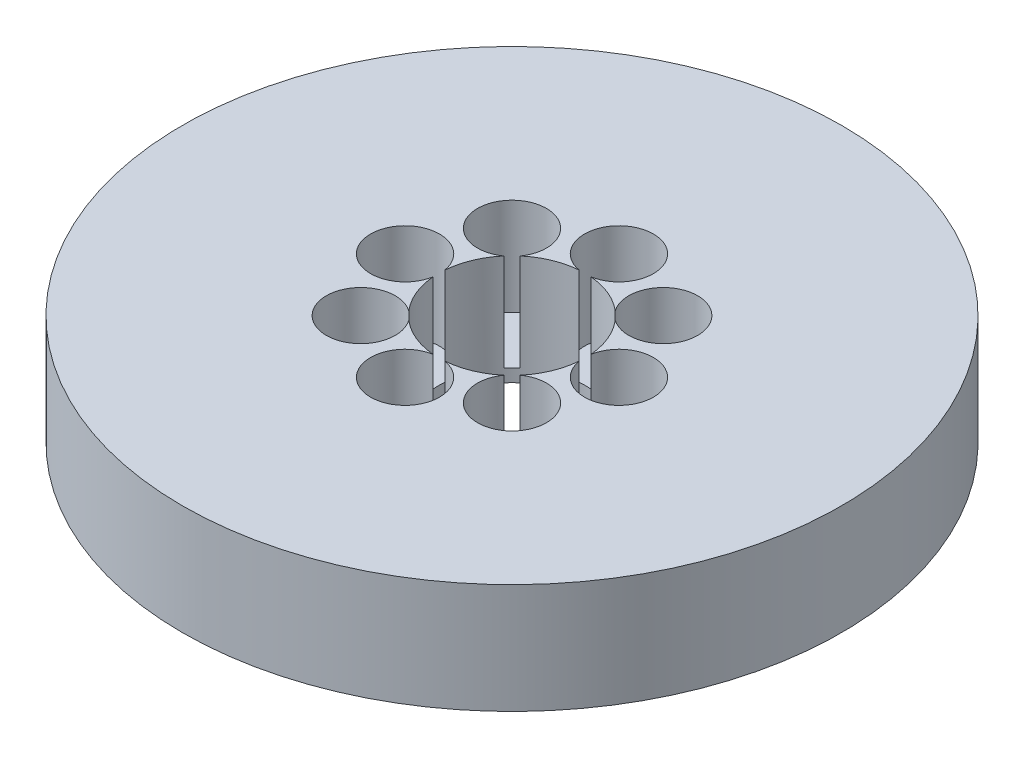
ISO-10303-21;
HEADER;
FILE_DESCRIPTION(('STEP AP214'),'2;1');
FILE_NAME('part.step','',(''),(''),'','','');
FILE_SCHEMA(('AUTOMOTIVE_DESIGN { 1 0 10303 214 1 1 1 1 }'));
ENDSEC;
DATA;
#1=APPLICATION_CONTEXT('core data for automotive mechanical design processes');
#2=APPLICATION_PROTOCOL_DEFINITION('international standard','automotive_design',2000,#1);
#3=PRODUCT_CONTEXT('',#1,'mechanical');
#4=PRODUCT('Part','Part','',(#3));
#5=PRODUCT_RELATED_PRODUCT_CATEGORY('part','',(#4));
#6=PRODUCT_DEFINITION_FORMATION('','',#4);
#7=PRODUCT_DEFINITION_CONTEXT('part definition',#1,'design');
#8=PRODUCT_DEFINITION('design','',#6,#7);
#9=PRODUCT_DEFINITION_SHAPE('','',#8);
#10=(LENGTH_UNIT() NAMED_UNIT(*) SI_UNIT(.MILLI.,.METRE.));
#11=(NAMED_UNIT(*) PLANE_ANGLE_UNIT() SI_UNIT($,.RADIAN.));
#12=(NAMED_UNIT(*) SI_UNIT($,.STERADIAN.) SOLID_ANGLE_UNIT());
#13=UNCERTAINTY_MEASURE_WITH_UNIT(LENGTH_MEASURE(1.E-05),#10,'distance_accuracy_value','');
#14=(GEOMETRIC_REPRESENTATION_CONTEXT(3) GLOBAL_UNCERTAINTY_ASSIGNED_CONTEXT((#13)) GLOBAL_UNIT_ASSIGNED_CONTEXT((#10,
#11,#12)) REPRESENTATION_CONTEXT('',''));
#15=CARTESIAN_POINT('',(0.,0.,0.));
#16=DIRECTION('',(0.,0.,1.));
#17=DIRECTION('',(1.,0.,0.));
#18=AXIS2_PLACEMENT_3D('',#15,#16,#17);
#19=CARTESIAN_POINT('',(0.,30.,0.));
#20=DIRECTION('',(0.,-1.,0.));
#21=DIRECTION('',(0.,0.,-1.));
#22=AXIS2_PLACEMENT_3D('',#19,#20,#21);
#23=CYLINDRICAL_SURFACE('',#22,90.);
#24=CARTESIAN_POINT('',(0.,30.,0.));
#25=DIRECTION('',(0.,1.,0.));
#26=DIRECTION('',(0.,0.,1.));
#27=AXIS2_PLACEMENT_3D('',#24,#25,#26);
#28=CIRCLE('',#27,90.);
#29=CARTESIAN_POINT('',(0.,30.,90.));
#30=VERTEX_POINT('',#29);
#31=EDGE_CURVE('E195',#30,#30,#28,.T.);
#32=ORIENTED_EDGE('',*,*,#31,.F.);
#33=EDGE_LOOP('',(#32));
#34=FACE_BOUND('',#33,.T.);
#35=CARTESIAN_POINT('',(0.,0.,0.));
#36=DIRECTION('',(0.,1.,0.));
#37=DIRECTION('',(0.,0.,1.));
#38=AXIS2_PLACEMENT_3D('',#35,#36,#37);
#39=CIRCLE('',#38,90.);
#40=CARTESIAN_POINT('',(0.,0.,90.));
#41=VERTEX_POINT('',#40);
#42=EDGE_CURVE('E179',#41,#41,#39,.T.);
#43=ORIENTED_EDGE('',*,*,#42,.T.);
#44=EDGE_LOOP('',(#43));
#45=FACE_BOUND('',#44,.T.);
#46=ADVANCED_FACE('F39',(#34,#45),#23,.T.);
#47=CARTESIAN_POINT('',(0.,30.,0.));
#48=DIRECTION('',(0.,1.,0.));
#49=DIRECTION('',(0.,0.,1.));
#50=AXIS2_PLACEMENT_3D('',#47,#48,#49);
#51=PLANE('',#50);
#52=CARTESIAN_POINT('',(1.01968902013866E-13,30.,29.2050542786669));
#53=DIRECTION('',(0.,1.,0.));
#54=DIRECTION('',(1.,0.,0.));
#55=AXIS2_PLACEMENT_3D('',#52,#53,#54);
#56=CIRCLE('',#55,9.40373495178159);
#57=CARTESIAN_POINT('',(-1.58993351933983,30.,19.9367026211478));
#58=VERTEX_POINT('',#57);
#59=CARTESIAN_POINT('',(1.58993351933997,30.,19.9367026211477));
#60=VERTEX_POINT('',#59);
#61=EDGE_CURVE('E176',#58,#60,#56,.T.);
#62=ORIENTED_EDGE('',*,*,#61,.F.);
#63=CARTESIAN_POINT('',(0.,30.,0.));
#64=DIRECTION('',(0.,1.,0.));
#65=DIRECTION('',(0.,0.,1.));
#66=AXIS2_PLACEMENT_3D('',#63,#64,#65);
#67=CIRCLE('',#66,20.);
#68=CARTESIAN_POINT('',(-12.9731248447521,30.,15.2216303910742));
#69=VERTEX_POINT('',#68);
#70=EDGE_CURVE('E166',#69,#58,#67,.T.);
#71=ORIENTED_EDGE('',*,*,#70,.F.);
#72=CARTESIAN_POINT('',(-20.6510919253665,30.,20.6510919253666));
#73=DIRECTION('',(0.,1.,0.));
#74=DIRECTION('',(0.707106781186549,0.,0.707106781186546));
#75=AXIS2_PLACEMENT_3D('',#72,#73,#74);
#76=CIRCLE('',#75,9.40373495178159);
#77=CARTESIAN_POINT('',(-15.2216303910742,30.,12.9731248447522));
#78=VERTEX_POINT('',#77);
#79=EDGE_CURVE('E147',#78,#69,#76,.T.);
#80=ORIENTED_EDGE('',*,*,#79,.F.);
#81=CARTESIAN_POINT('',(-19.9367026211477,30.,1.5899335193399));
#82=VERTEX_POINT('',#81);
#83=EDGE_CURVE('E180',#82,#78,#67,.T.);
#84=ORIENTED_EDGE('',*,*,#83,.F.);
#85=CARTESIAN_POINT('',(-29.2050542786669,30.,0.));
#86=DIRECTION('',(0.,1.,0.));
#87=DIRECTION('',(0.,0.,1.));
#88=AXIS2_PLACEMENT_3D('',#85,#86,#87);
#89=CIRCLE('',#88,9.40373495178159);
#90=CARTESIAN_POINT('',(-19.9367026211477,30.,-1.5899335193399));
#91=VERTEX_POINT('',#90);
#92=EDGE_CURVE('E186',#91,#82,#89,.T.);
#93=ORIENTED_EDGE('',*,*,#92,.F.);
#94=CARTESIAN_POINT('',(-15.2216303910744,30.,-12.973124844752));
#95=VERTEX_POINT('',#94);
#96=EDGE_CURVE('E182',#95,#91,#67,.T.);
#97=ORIENTED_EDGE('',*,*,#96,.F.);
#98=CARTESIAN_POINT('',(-20.6510919253668,30.,-20.6510919253663));
#99=DIRECTION('',(0.,1.,0.));
#100=DIRECTION('',(-0.707106781186539,0.,0.707106781186556));
#101=AXIS2_PLACEMENT_3D('',#98,#99,#100);
#102=CIRCLE('',#101,9.40373495178159);
#103=CARTESIAN_POINT('',(-12.9731248447523,30.,-15.2216303910741));
#104=VERTEX_POINT('',#103);
#105=EDGE_CURVE('E446',#104,#95,#102,.T.);
#106=ORIENTED_EDGE('',*,*,#105,.F.);
#107=CARTESIAN_POINT('',(-1.58993351934011,30.,-19.9367026211477));
#108=VERTEX_POINT('',#107);
#109=EDGE_CURVE('E452',#108,#104,#67,.T.);
#110=ORIENTED_EDGE('',*,*,#109,.F.);
#111=CARTESIAN_POINT('',(-3.05906706041599E-13,30.,-29.2050542786669));
#112=DIRECTION('',(0.,1.,0.));
#113=DIRECTION('',(-1.,0.,0.));
#114=AXIS2_PLACEMENT_3D('',#111,#112,#113);
#115=CIRCLE('',#114,9.40373495178159);
#116=CARTESIAN_POINT('',(1.58993351933969,30.,-19.9367026211478));
#117=VERTEX_POINT('',#116);
#118=EDGE_CURVE('E477',#117,#108,#115,.T.);
#119=ORIENTED_EDGE('',*,*,#118,.F.);
#120=CARTESIAN_POINT('',(12.973124844752,30.,-15.2216303910743));
#121=VERTEX_POINT('',#120);
#122=EDGE_CURVE('E460',#121,#117,#67,.T.);
#123=ORIENTED_EDGE('',*,*,#122,.F.);
#124=CARTESIAN_POINT('',(20.6510919253664,30.,-20.6510919253667));
#125=DIRECTION('',(0.,1.,0.));
#126=DIRECTION('',(-0.707106781186554,0.,-0.707106781186541));
#127=AXIS2_PLACEMENT_3D('',#124,#125,#126);
#128=CIRCLE('',#127,9.40373495178159);
#129=CARTESIAN_POINT('',(15.2216303910741,30.,-12.9731248447523));
#130=VERTEX_POINT('',#129);
#131=EDGE_CURVE('E464',#130,#121,#128,.T.);
#132=ORIENTED_EDGE('',*,*,#131,.F.);
#133=CARTESIAN_POINT('',(19.9367026211477,30.,-1.5899335193399));
#134=VERTEX_POINT('',#133);
#135=EDGE_CURVE('E459',#134,#130,#67,.T.);
#136=ORIENTED_EDGE('',*,*,#135,.F.);
#137=CARTESIAN_POINT('',(29.2050542786669,30.,0.));
#138=DIRECTION('',(0.,1.,0.));
#139=DIRECTION('',(0.,0.,-1.));
#140=AXIS2_PLACEMENT_3D('',#137,#138,#139);
#141=CIRCLE('',#140,9.40373495178159);
#142=CARTESIAN_POINT('',(19.9367026211477,30.,1.5899335193399));
#143=VERTEX_POINT('',#142);
#144=EDGE_CURVE('E469',#143,#134,#141,.T.);
#145=ORIENTED_EDGE('',*,*,#144,.F.);
#146=CARTESIAN_POINT('',(15.2216303910743,30.,12.9731248447521));
#147=VERTEX_POINT('',#146);
#148=EDGE_CURVE('E181',#147,#143,#67,.T.);
#149=ORIENTED_EDGE('',*,*,#148,.F.);
#150=CARTESIAN_POINT('',(20.6510919253667,30.,20.6510919253665));
#151=DIRECTION('',(0.,1.,0.));
#152=DIRECTION('',(0.707106781186544,0.,-0.707106781186551));
#153=AXIS2_PLACEMENT_3D('',#150,#151,#152);
#154=CIRCLE('',#153,9.40373495178159);
#155=CARTESIAN_POINT('',(12.9731248447522,30.,15.2216303910742));
#156=VERTEX_POINT('',#155);
#157=EDGE_CURVE('E475',#156,#147,#154,.T.);
#158=ORIENTED_EDGE('',*,*,#157,.F.);
#159=EDGE_CURVE('E177',#60,#156,#67,.T.);
#160=ORIENTED_EDGE('',*,*,#159,.F.);
#161=EDGE_LOOP('',(#62,#71,#80,#84,#93,#97,#106,#110,#119,#123,#132,#136,#145,#149,#158,#160));
#162=FACE_BOUND('',#161,.T.);
#163=ORIENTED_EDGE('',*,*,#31,.T.);
#164=EDGE_LOOP('',(#163));
#165=FACE_BOUND('',#164,.T.);
#166=ADVANCED_FACE('F172',(#162,#165),#51,.T.);
#167=CARTESIAN_POINT('',(0.,0.,0.));
#168=DIRECTION('',(0.,1.,0.));
#169=DIRECTION('',(0.,0.,1.));
#170=AXIS2_PLACEMENT_3D('',#167,#168,#169);
#171=PLANE('',#170);
#172=CARTESIAN_POINT('',(0.,0.,0.));
#173=DIRECTION('',(0.,1.,0.));
#174=DIRECTION('',(0.,0.,1.));
#175=AXIS2_PLACEMENT_3D('',#172,#173,#174);
#176=CIRCLE('',#175,20.);
#177=CARTESIAN_POINT('',(0.,0.,20.));
#178=VERTEX_POINT('',#177);
#179=EDGE_CURVE('E187',#178,#178,#176,.T.);
#180=ORIENTED_EDGE('',*,*,#179,.T.);
#181=EDGE_LOOP('',(#180));
#182=FACE_BOUND('',#181,.T.);
#183=ORIENTED_EDGE('',*,*,#42,.F.);
#184=EDGE_LOOP('',(#183));
#185=FACE_BOUND('',#184,.T.);
#186=ADVANCED_FACE('F270',(#182,#185),#171,.F.);
#187=CARTESIAN_POINT('',(0.,30.,0.));
#188=DIRECTION('',(0.,-1.,0.));
#189=DIRECTION('',(0.,0.,-1.));
#190=AXIS2_PLACEMENT_3D('',#187,#188,#189);
#191=CYLINDRICAL_SURFACE('',#190,20.);
#192=DIRECTION('',(0.,1.,0.));
#193=VECTOR('',#192,1.);
#194=CARTESIAN_POINT('',(-1.58993351933985,16.7364549688149,19.9367026211478));
#195=LINE('',#194,#193);
#196=CARTESIAN_POINT('',(-1.58993351933983,3.47290993762979,19.9367026211478));
#197=VERTEX_POINT('',#196);
#198=EDGE_CURVE('E11',#197,#58,#195,.T.);
#199=ORIENTED_EDGE('',*,*,#198,.F.);
#200=CARTESIAN_POINT('',(0.,3.47290993762979,0.));
#201=DIRECTION('',(0.,1.,0.));
#202=DIRECTION('',(0.,0.,1.));
#203=AXIS2_PLACEMENT_3D('',#200,#201,#202);
#204=CIRCLE('',#203,20.);
#205=CARTESIAN_POINT('',(1.58993351933997,3.47290993762979,19.9367026211477));
#206=VERTEX_POINT('',#205);
#207=EDGE_CURVE('E250',#197,#206,#204,.T.);
#208=ORIENTED_EDGE('',*,*,#207,.T.);
#209=DIRECTION('',(0.,1.,0.));
#210=VECTOR('',#209,1.);
#211=CARTESIAN_POINT('',(1.58993351933999,16.7364549688149,19.9367026211477));
#212=LINE('',#211,#210);
#213=EDGE_CURVE('E46',#60,#206,#212,.F.);
#214=ORIENTED_EDGE('',*,*,#213,.F.);
#215=ORIENTED_EDGE('',*,*,#159,.T.);
#216=DIRECTION('',(0.,1.,0.));
#217=VECTOR('',#216,1.);
#218=CARTESIAN_POINT('',(12.9731248447522,16.7364549688149,15.2216303910742));
#219=LINE('',#218,#217);
#220=CARTESIAN_POINT('',(12.9731248447522,3.47290993762979,15.2216303910742));
#221=VERTEX_POINT('',#220);
#222=EDGE_CURVE('E244',#221,#156,#219,.T.);
#223=ORIENTED_EDGE('',*,*,#222,.F.);
#224=CARTESIAN_POINT('',(0.,3.47290993762979,0.));
#225=DIRECTION('',(0.,1.,0.));
#226=DIRECTION('',(0.,0.,1.));
#227=AXIS2_PLACEMENT_3D('',#224,#225,#226);
#228=CIRCLE('',#227,20.);
#229=CARTESIAN_POINT('',(15.2216303910743,3.47290993762979,12.9731248447521));
#230=VERTEX_POINT('',#229);
#231=EDGE_CURVE('E238',#221,#230,#228,.T.);
#232=ORIENTED_EDGE('',*,*,#231,.T.);
#233=DIRECTION('',(0.,1.,0.));
#234=VECTOR('',#233,1.);
#235=CARTESIAN_POINT('',(15.2216303910743,16.7364549688149,12.9731248447521));
#236=LINE('',#235,#234);
#237=EDGE_CURVE('E242',#147,#230,#236,.F.);
#238=ORIENTED_EDGE('',*,*,#237,.F.);
#239=ORIENTED_EDGE('',*,*,#148,.T.);
#240=DIRECTION('',(0.,1.,0.));
#241=VECTOR('',#240,1.);
#242=CARTESIAN_POINT('',(19.9367026211477,16.7364549688149,1.58993351933992));
#243=LINE('',#242,#241);
#244=CARTESIAN_POINT('',(19.9367026211477,3.47290993762979,1.5899335193399));
#245=VERTEX_POINT('',#244);
#246=EDGE_CURVE('E236',#245,#143,#243,.T.);
#247=ORIENTED_EDGE('',*,*,#246,.F.);
#248=CARTESIAN_POINT('',(0.,3.47290993762979,0.));
#249=DIRECTION('',(0.,1.,0.));
#250=DIRECTION('',(0.,0.,1.));
#251=AXIS2_PLACEMENT_3D('',#248,#249,#250);
#252=CIRCLE('',#251,20.);
#253=CARTESIAN_POINT('',(19.9367026211477,3.47290993762979,-1.5899335193399));
#254=VERTEX_POINT('',#253);
#255=EDGE_CURVE('E235',#245,#254,#252,.T.);
#256=ORIENTED_EDGE('',*,*,#255,.T.);
#257=DIRECTION('',(0.,1.,0.));
#258=VECTOR('',#257,1.);
#259=CARTESIAN_POINT('',(19.9367026211477,16.7364549688149,-1.58993351933992));
#260=LINE('',#259,#258);
#261=EDGE_CURVE('E234',#134,#254,#260,.F.);
#262=ORIENTED_EDGE('',*,*,#261,.F.);
#263=ORIENTED_EDGE('',*,*,#135,.T.);
#264=DIRECTION('',(0.,1.,0.));
#265=VECTOR('',#264,1.);
#266=CARTESIAN_POINT('',(15.2216303910741,16.7364549688149,-12.9731248447523));
#267=LINE('',#266,#265);
#268=CARTESIAN_POINT('',(15.2216303910741,3.47290993762979,-12.9731248447523));
#269=VERTEX_POINT('',#268);
#270=EDGE_CURVE('E229',#269,#130,#267,.T.);
#271=ORIENTED_EDGE('',*,*,#270,.F.);
#272=CARTESIAN_POINT('',(0.,3.47290993762979,0.));
#273=DIRECTION('',(0.,1.,0.));
#274=DIRECTION('',(0.,0.,1.));
#275=AXIS2_PLACEMENT_3D('',#272,#273,#274);
#276=CIRCLE('',#275,20.);
#277=CARTESIAN_POINT('',(12.973124844752,3.47290993762979,-15.2216303910743));
#278=VERTEX_POINT('',#277);
#279=EDGE_CURVE('E221',#269,#278,#276,.T.);
#280=ORIENTED_EDGE('',*,*,#279,.T.);
#281=DIRECTION('',(0.,1.,0.));
#282=VECTOR('',#281,1.);
#283=CARTESIAN_POINT('',(12.973124844752,16.7364549688149,-15.2216303910744));
#284=LINE('',#283,#282);
#285=EDGE_CURVE('E230',#121,#278,#284,.F.);
#286=ORIENTED_EDGE('',*,*,#285,.F.);
#287=ORIENTED_EDGE('',*,*,#122,.T.);
#288=DIRECTION('',(0.,1.,0.));
#289=VECTOR('',#288,1.);
#290=CARTESIAN_POINT('',(1.58993351933972,16.7364549688149,-19.9367026211478));
#291=LINE('',#290,#289);
#292=CARTESIAN_POINT('',(1.58993351933969,3.47290993762979,-19.9367026211478));
#293=VERTEX_POINT('',#292);
#294=EDGE_CURVE('E225',#293,#117,#291,.T.);
#295=ORIENTED_EDGE('',*,*,#294,.F.);
#296=CARTESIAN_POINT('',(0.,3.47290993762979,0.));
#297=DIRECTION('',(0.,1.,0.));
#298=DIRECTION('',(0.,0.,1.));
#299=AXIS2_PLACEMENT_3D('',#296,#297,#298);
#300=CIRCLE('',#299,20.);
#301=CARTESIAN_POINT('',(-1.58993351934011,3.47290993762979,-19.9367026211477));
#302=VERTEX_POINT('',#301);
#303=EDGE_CURVE('E216',#293,#302,#300,.T.);
#304=ORIENTED_EDGE('',*,*,#303,.T.);
#305=DIRECTION('',(0.,1.,0.));
#306=VECTOR('',#305,1.);
#307=CARTESIAN_POINT('',(-1.58993351934013,16.7364549688149,-19.9367026211477));
#308=LINE('',#307,#306);
#309=EDGE_CURVE('E218',#108,#302,#308,.F.);
#310=ORIENTED_EDGE('',*,*,#309,.F.);
#311=ORIENTED_EDGE('',*,*,#109,.T.);
#312=DIRECTION('',(0.,1.,0.));
#313=VECTOR('',#312,1.);
#314=CARTESIAN_POINT('',(-12.9731248447523,16.7364549688149,-15.2216303910741));
#315=LINE('',#314,#313);
#316=CARTESIAN_POINT('',(-12.9731248447523,3.47290993762979,-15.2216303910741));
#317=VERTEX_POINT('',#316);
#318=EDGE_CURVE('E212',#317,#104,#315,.T.);
#319=ORIENTED_EDGE('',*,*,#318,.F.);
#320=CARTESIAN_POINT('',(0.,3.47290993762979,0.));
#321=DIRECTION('',(0.,1.,0.));
#322=DIRECTION('',(0.,0.,1.));
#323=AXIS2_PLACEMENT_3D('',#320,#321,#322);
#324=CIRCLE('',#323,20.);
#325=CARTESIAN_POINT('',(-15.2216303910744,3.47290993762979,-12.973124844752));
#326=VERTEX_POINT('',#325);
#327=EDGE_CURVE('E208',#317,#326,#324,.T.);
#328=ORIENTED_EDGE('',*,*,#327,.T.);
#329=DIRECTION('',(0.,1.,0.));
#330=VECTOR('',#329,1.);
#331=CARTESIAN_POINT('',(-15.2216303910744,16.7364549688149,-12.973124844752));
#332=LINE('',#331,#330);
#333=EDGE_CURVE('E211',#95,#326,#332,.F.);
#334=ORIENTED_EDGE('',*,*,#333,.F.);
#335=ORIENTED_EDGE('',*,*,#96,.T.);
#336=DIRECTION('',(0.,1.,0.));
#337=VECTOR('',#336,1.);
#338=CARTESIAN_POINT('',(-19.9367026211477,16.7364549688149,-1.58993351933992));
#339=LINE('',#338,#337);
#340=CARTESIAN_POINT('',(-19.9367026211477,3.47290993762979,-1.5899335193399));
#341=VERTEX_POINT('',#340);
#342=EDGE_CURVE('E201',#341,#91,#339,.T.);
#343=ORIENTED_EDGE('',*,*,#342,.F.);
#344=CARTESIAN_POINT('',(0.,3.47290993762979,0.));
#345=DIRECTION('',(0.,1.,0.));
#346=DIRECTION('',(0.,0.,1.));
#347=AXIS2_PLACEMENT_3D('',#344,#345,#346);
#348=CIRCLE('',#347,20.);
#349=CARTESIAN_POINT('',(-19.9367026211477,3.47290993762979,1.5899335193399));
#350=VERTEX_POINT('',#349);
#351=EDGE_CURVE('E194',#341,#350,#348,.T.);
#352=ORIENTED_EDGE('',*,*,#351,.T.);
#353=DIRECTION('',(0.,1.,0.));
#354=VECTOR('',#353,1.);
#355=CARTESIAN_POINT('',(-19.9367026211477,16.7364549688149,1.58993351933992));
#356=LINE('',#355,#354);
#357=EDGE_CURVE('E199',#82,#350,#356,.F.);
#358=ORIENTED_EDGE('',*,*,#357,.F.);
#359=ORIENTED_EDGE('',*,*,#83,.T.);
#360=DIRECTION('',(0.,1.,0.));
#361=VECTOR('',#360,1.);
#362=CARTESIAN_POINT('',(-15.2216303910742,16.7364549688149,12.9731248447522));
#363=LINE('',#362,#361);
#364=CARTESIAN_POINT('',(-15.2216303910742,3.47290993762979,12.9731248447522));
#365=VERTEX_POINT('',#364);
#366=EDGE_CURVE('E160',#365,#78,#363,.T.);
#367=ORIENTED_EDGE('',*,*,#366,.F.);
#368=CARTESIAN_POINT('',(0.,3.47290993762979,0.));
#369=DIRECTION('',(0.,1.,0.));
#370=DIRECTION('',(0.,0.,1.));
#371=AXIS2_PLACEMENT_3D('',#368,#369,#370);
#372=CIRCLE('',#371,20.);
#373=CARTESIAN_POINT('',(-12.9731248447521,3.47290993762979,15.2216303910742));
#374=VERTEX_POINT('',#373);
#375=EDGE_CURVE('E168',#365,#374,#372,.T.);
#376=ORIENTED_EDGE('',*,*,#375,.T.);
#377=DIRECTION('',(0.,1.,0.));
#378=VECTOR('',#377,1.);
#379=CARTESIAN_POINT('',(-12.9731248447521,16.7364549688149,15.2216303910743));
#380=LINE('',#379,#378);
#381=EDGE_CURVE('E152',#69,#374,#380,.F.);
#382=ORIENTED_EDGE('',*,*,#381,.F.);
#383=ORIENTED_EDGE('',*,*,#70,.T.);
#384=EDGE_LOOP('',(#199,#208,#214,#215,#223,#232,#238,#239,#247,#256,#262,#263,#271,#280,#286,
#287,#295,#304,#310,#311,#319,#328,#334,#335,#343,#352,#358,#359,#367,#376,#382,#383));
#385=FACE_BOUND('',#384,.T.);
#386=ORIENTED_EDGE('',*,*,#179,.F.);
#387=EDGE_LOOP('',(#386));
#388=FACE_BOUND('',#387,.T.);
#389=ADVANCED_FACE('F170',(#385,#388),#191,.F.);
#390=CARTESIAN_POINT('',(-29.2050542786669,3.47290993762979,0.));
#391=DIRECTION('',(0.,1.,0.));
#392=DIRECTION('',(0.,0.,1.));
#393=AXIS2_PLACEMENT_3D('',#390,#391,#392);
#394=CYLINDRICAL_SURFACE('',#393,9.40373495178159);
#395=ORIENTED_EDGE('',*,*,#342,.T.);
#396=ORIENTED_EDGE('',*,*,#92,.T.);
#397=ORIENTED_EDGE('',*,*,#357,.T.);
#398=CARTESIAN_POINT('',(-29.2050542786669,3.47290993762979,0.));
#399=DIRECTION('',(0.,1.,0.));
#400=DIRECTION('',(0.,0.,1.));
#401=AXIS2_PLACEMENT_3D('',#398,#399,#400);
#402=CIRCLE('',#401,9.40373495178159);
#403=EDGE_CURVE('E191',#341,#350,#402,.T.);
#404=ORIENTED_EDGE('',*,*,#403,.F.);
#405=EDGE_LOOP('',(#395,#396,#397,#404));
#406=FACE_BOUND('',#405,.T.);
#407=ADVANCED_FACE('F279',(#406),#394,.F.);
#408=CARTESIAN_POINT('',(-29.2050542786669,3.47290993762979,0.));
#409=DIRECTION('',(0.,1.,0.));
#410=DIRECTION('',(0.,0.,1.));
#411=AXIS2_PLACEMENT_3D('',#408,#409,#410);
#412=PLANE('',#411);
#413=ORIENTED_EDGE('',*,*,#403,.T.);
#414=ORIENTED_EDGE('',*,*,#351,.F.);
#415=EDGE_LOOP('',(#413,#414));
#416=FACE_BOUND('',#415,.T.);
#417=ADVANCED_FACE('F285',(#416),#412,.T.);
#418=CARTESIAN_POINT('',(-20.6510919253665,3.47290993762979,20.6510919253666));
#419=DIRECTION('',(0.,1.,0.));
#420=DIRECTION('',(0.,0.,1.));
#421=AXIS2_PLACEMENT_3D('',#418,#419,#420);
#422=CYLINDRICAL_SURFACE('',#421,9.40373495178159);
#423=ORIENTED_EDGE('',*,*,#366,.T.);
#424=ORIENTED_EDGE('',*,*,#79,.T.);
#425=ORIENTED_EDGE('',*,*,#381,.T.);
#426=CARTESIAN_POINT('',(-20.6510919253665,3.47290993762979,20.6510919253666));
#427=DIRECTION('',(0.,1.,0.));
#428=DIRECTION('',(0.707106781186549,0.,0.707106781186546));
#429=AXIS2_PLACEMENT_3D('',#426,#427,#428);
#430=CIRCLE('',#429,9.40373495178159);
#431=EDGE_CURVE('E165',#365,#374,#430,.T.);
#432=ORIENTED_EDGE('',*,*,#431,.F.);
#433=EDGE_LOOP('',(#423,#424,#425,#432));
#434=FACE_BOUND('',#433,.T.);
#435=ADVANCED_FACE('F155',(#434),#422,.F.);
#436=CARTESIAN_POINT('',(-20.6510919253665,3.47290993762979,20.6510919253666));
#437=DIRECTION('',(0.,1.,0.));
#438=DIRECTION('',(0.707106781186549,0.,0.707106781186546));
#439=AXIS2_PLACEMENT_3D('',#436,#437,#438);
#440=PLANE('',#439);
#441=ORIENTED_EDGE('',*,*,#431,.T.);
#442=ORIENTED_EDGE('',*,*,#375,.F.);
#443=EDGE_LOOP('',(#441,#442));
#444=FACE_BOUND('',#443,.T.);
#445=ADVANCED_FACE('F288',(#444),#440,.T.);
#446=CARTESIAN_POINT('',(-20.6510919253668,3.47290993762979,-20.6510919253663));
#447=DIRECTION('',(0.,1.,0.));
#448=DIRECTION('',(0.,0.,1.));
#449=AXIS2_PLACEMENT_3D('',#446,#447,#448);
#450=CYLINDRICAL_SURFACE('',#449,9.40373495178159);
#451=ORIENTED_EDGE('',*,*,#318,.T.);
#452=ORIENTED_EDGE('',*,*,#105,.T.);
#453=ORIENTED_EDGE('',*,*,#333,.T.);
#454=CARTESIAN_POINT('',(-20.6510919253668,3.47290993762979,-20.6510919253663));
#455=DIRECTION('',(0.,1.,0.));
#456=DIRECTION('',(-0.707106781186539,0.,0.707106781186556));
#457=AXIS2_PLACEMENT_3D('',#454,#455,#456);
#458=CIRCLE('',#457,9.40373495178159);
#459=EDGE_CURVE('E447',#317,#326,#458,.T.);
#460=ORIENTED_EDGE('',*,*,#459,.F.);
#461=EDGE_LOOP('',(#451,#452,#453,#460));
#462=FACE_BOUND('',#461,.T.);
#463=ADVANCED_FACE('F295',(#462),#450,.F.);
#464=CARTESIAN_POINT('',(-20.6510919253668,3.47290993762979,-20.6510919253663));
#465=DIRECTION('',(0.,1.,0.));
#466=DIRECTION('',(-0.707106781186539,0.,0.707106781186556));
#467=AXIS2_PLACEMENT_3D('',#464,#465,#466);
#468=PLANE('',#467);
#469=ORIENTED_EDGE('',*,*,#459,.T.);
#470=ORIENTED_EDGE('',*,*,#327,.F.);
#471=EDGE_LOOP('',(#469,#470));
#472=FACE_BOUND('',#471,.T.);
#473=ADVANCED_FACE('F375',(#472),#468,.T.);
#474=CARTESIAN_POINT('',(-3.05906706041599E-13,3.47290993762979,-29.2050542786669));
#475=DIRECTION('',(0.,1.,0.));
#476=DIRECTION('',(0.,0.,1.));
#477=AXIS2_PLACEMENT_3D('',#474,#475,#476);
#478=CYLINDRICAL_SURFACE('',#477,9.40373495178159);
#479=ORIENTED_EDGE('',*,*,#294,.T.);
#480=ORIENTED_EDGE('',*,*,#118,.T.);
#481=ORIENTED_EDGE('',*,*,#309,.T.);
#482=CARTESIAN_POINT('',(-3.05906706041599E-13,3.47290993762979,-29.2050542786669));
#483=DIRECTION('',(0.,1.,0.));
#484=DIRECTION('',(-1.,0.,0.));
#485=AXIS2_PLACEMENT_3D('',#482,#483,#484);
#486=CIRCLE('',#485,9.40373495178159);
#487=EDGE_CURVE('E467',#293,#302,#486,.T.);
#488=ORIENTED_EDGE('',*,*,#487,.F.);
#489=EDGE_LOOP('',(#479,#480,#481,#488));
#490=FACE_BOUND('',#489,.T.);
#491=ADVANCED_FACE('F361',(#490),#478,.F.);
#492=CARTESIAN_POINT('',(-3.05906706041599E-13,3.47290993762979,-29.2050542786669));
#493=DIRECTION('',(0.,1.,0.));
#494=DIRECTION('',(-1.,0.,0.));
#495=AXIS2_PLACEMENT_3D('',#492,#493,#494);
#496=PLANE('',#495);
#497=ORIENTED_EDGE('',*,*,#487,.T.);
#498=ORIENTED_EDGE('',*,*,#303,.F.);
#499=EDGE_LOOP('',(#497,#498));
#500=FACE_BOUND('',#499,.T.);
#501=ADVANCED_FACE('F297',(#500),#496,.T.);
#502=CARTESIAN_POINT('',(20.6510919253664,3.47290993762979,-20.6510919253667));
#503=DIRECTION('',(0.,1.,0.));
#504=DIRECTION('',(0.,0.,1.));
#505=AXIS2_PLACEMENT_3D('',#502,#503,#504);
#506=CYLINDRICAL_SURFACE('',#505,9.40373495178159);
#507=ORIENTED_EDGE('',*,*,#270,.T.);
#508=ORIENTED_EDGE('',*,*,#131,.T.);
#509=ORIENTED_EDGE('',*,*,#285,.T.);
#510=CARTESIAN_POINT('',(20.6510919253664,3.47290993762979,-20.6510919253667));
#511=DIRECTION('',(0.,1.,0.));
#512=DIRECTION('',(-0.707106781186554,0.,-0.707106781186541));
#513=AXIS2_PLACEMENT_3D('',#510,#511,#512);
#514=CIRCLE('',#513,9.40373495178159);
#515=EDGE_CURVE('E470',#269,#278,#514,.T.);
#516=ORIENTED_EDGE('',*,*,#515,.F.);
#517=EDGE_LOOP('',(#507,#508,#509,#516));
#518=FACE_BOUND('',#517,.T.);
#519=ADVANCED_FACE('F294',(#518),#506,.F.);
#520=CARTESIAN_POINT('',(20.6510919253664,3.47290993762979,-20.6510919253667));
#521=DIRECTION('',(0.,1.,0.));
#522=DIRECTION('',(-0.707106781186554,0.,-0.707106781186541));
#523=AXIS2_PLACEMENT_3D('',#520,#521,#522);
#524=PLANE('',#523);
#525=ORIENTED_EDGE('',*,*,#515,.T.);
#526=ORIENTED_EDGE('',*,*,#279,.F.);
#527=EDGE_LOOP('',(#525,#526));
#528=FACE_BOUND('',#527,.T.);
#529=ADVANCED_FACE('F300',(#528),#524,.T.);
#530=CARTESIAN_POINT('',(29.2050542786669,3.47290993762979,0.));
#531=DIRECTION('',(0.,1.,0.));
#532=DIRECTION('',(0.,0.,1.));
#533=AXIS2_PLACEMENT_3D('',#530,#531,#532);
#534=CYLINDRICAL_SURFACE('',#533,9.40373495178159);
#535=ORIENTED_EDGE('',*,*,#246,.T.);
#536=ORIENTED_EDGE('',*,*,#144,.T.);
#537=ORIENTED_EDGE('',*,*,#261,.T.);
#538=CARTESIAN_POINT('',(29.2050542786669,3.47290993762979,0.));
#539=DIRECTION('',(0.,1.,0.));
#540=DIRECTION('',(0.,0.,-1.));
#541=AXIS2_PLACEMENT_3D('',#538,#539,#540);
#542=CIRCLE('',#541,9.40373495178159);
#543=EDGE_CURVE('E472',#245,#254,#542,.T.);
#544=ORIENTED_EDGE('',*,*,#543,.F.);
#545=EDGE_LOOP('',(#535,#536,#537,#544));
#546=FACE_BOUND('',#545,.T.);
#547=ADVANCED_FACE('F305',(#546),#534,.F.);
#548=CARTESIAN_POINT('',(29.2050542786669,3.47290993762979,0.));
#549=DIRECTION('',(0.,1.,0.));
#550=DIRECTION('',(0.,0.,-1.));
#551=AXIS2_PLACEMENT_3D('',#548,#549,#550);
#552=PLANE('',#551);
#553=ORIENTED_EDGE('',*,*,#543,.T.);
#554=ORIENTED_EDGE('',*,*,#255,.F.);
#555=EDGE_LOOP('',(#553,#554));
#556=FACE_BOUND('',#555,.T.);
#557=ADVANCED_FACE('F308',(#556),#552,.T.);
#558=CARTESIAN_POINT('',(20.6510919253667,3.47290993762979,20.6510919253665));
#559=DIRECTION('',(0.,1.,0.));
#560=DIRECTION('',(0.,0.,1.));
#561=AXIS2_PLACEMENT_3D('',#558,#559,#560);
#562=CYLINDRICAL_SURFACE('',#561,9.40373495178159);
#563=ORIENTED_EDGE('',*,*,#222,.T.);
#564=ORIENTED_EDGE('',*,*,#157,.T.);
#565=ORIENTED_EDGE('',*,*,#237,.T.);
#566=CARTESIAN_POINT('',(20.6510919253667,3.47290993762979,20.6510919253665));
#567=DIRECTION('',(0.,1.,0.));
#568=DIRECTION('',(0.707106781186544,0.,-0.707106781186551));
#569=AXIS2_PLACEMENT_3D('',#566,#567,#568);
#570=CIRCLE('',#569,9.40373495178159);
#571=EDGE_CURVE('E56',#221,#230,#570,.T.);
#572=ORIENTED_EDGE('',*,*,#571,.F.);
#573=EDGE_LOOP('',(#563,#564,#565,#572));
#574=FACE_BOUND('',#573,.T.);
#575=ADVANCED_FACE('F309',(#574),#562,.F.);
#576=CARTESIAN_POINT('',(20.6510919253667,3.47290993762979,20.6510919253665));
#577=DIRECTION('',(0.,1.,0.));
#578=DIRECTION('',(0.707106781186544,0.,-0.707106781186551));
#579=AXIS2_PLACEMENT_3D('',#576,#577,#578);
#580=PLANE('',#579);
#581=ORIENTED_EDGE('',*,*,#571,.T.);
#582=ORIENTED_EDGE('',*,*,#231,.F.);
#583=EDGE_LOOP('',(#581,#582));
#584=FACE_BOUND('',#583,.T.);
#585=ADVANCED_FACE('F256',(#584),#580,.T.);
#586=CARTESIAN_POINT('',(1.01968902013866E-13,3.47290993762979,29.2050542786669));
#587=DIRECTION('',(0.,1.,0.));
#588=DIRECTION('',(0.,0.,1.));
#589=AXIS2_PLACEMENT_3D('',#586,#587,#588);
#590=CYLINDRICAL_SURFACE('',#589,9.40373495178159);
#591=ORIENTED_EDGE('',*,*,#198,.T.);
#592=ORIENTED_EDGE('',*,*,#61,.T.);
#593=ORIENTED_EDGE('',*,*,#213,.T.);
#594=CARTESIAN_POINT('',(1.01968902013866E-13,3.47290993762979,29.2050542786669));
#595=DIRECTION('',(0.,1.,0.));
#596=DIRECTION('',(1.,0.,0.));
#597=AXIS2_PLACEMENT_3D('',#594,#595,#596);
#598=CIRCLE('',#597,9.40373495178159);
#599=EDGE_CURVE('E55',#197,#206,#598,.T.);
#600=ORIENTED_EDGE('',*,*,#599,.F.);
#601=EDGE_LOOP('',(#591,#592,#593,#600));
#602=FACE_BOUND('',#601,.T.);
#603=ADVANCED_FACE('F253',(#602),#590,.F.);
#604=CARTESIAN_POINT('',(1.01968902013866E-13,3.47290993762979,29.2050542786669));
#605=DIRECTION('',(0.,1.,0.));
#606=DIRECTION('',(1.,0.,0.));
#607=AXIS2_PLACEMENT_3D('',#604,#605,#606);
#608=PLANE('',#607);
#609=ORIENTED_EDGE('',*,*,#599,.T.);
#610=ORIENTED_EDGE('',*,*,#207,.F.);
#611=EDGE_LOOP('',(#609,#610));
#612=FACE_BOUND('',#611,.T.);
#613=ADVANCED_FACE('F252',(#612),#608,.T.);
#614=CLOSED_SHELL('',(#46,#166,#186,#389,#407,#417,#435,#445,#463,#473,#491,#501,#519,#529,#547,
#557,#575,#585,#603,#613));
#615=MANIFOLD_SOLID_BREP('B2',#614);
#616=ADVANCED_BREP_SHAPE_REPRESENTATION('',(#18,#615),#14);
#617=SHAPE_DEFINITION_REPRESENTATION(#9,#616);
ENDSEC;
END-ISO-10303-21;
